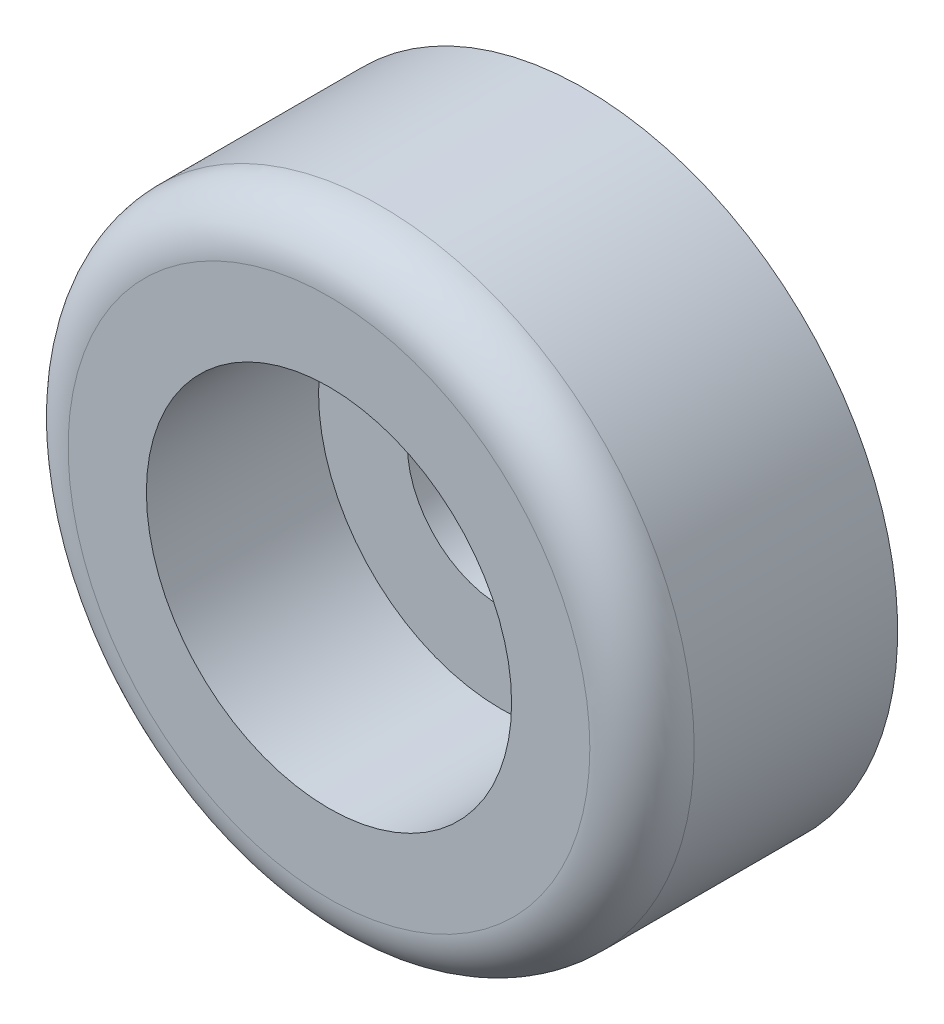
ISO-10303-21;
HEADER;
FILE_DESCRIPTION(('STEP AP214'),'2;1');
FILE_NAME('part.step','',(''),(''),'','','');
FILE_SCHEMA(('AUTOMOTIVE_DESIGN { 1 0 10303 214 1 1 1 1 }'));
ENDSEC;
DATA;
#1=APPLICATION_CONTEXT('core data for automotive mechanical design processes');
#2=APPLICATION_PROTOCOL_DEFINITION('international standard','automotive_design',2000,#1);
#3=PRODUCT_CONTEXT('',#1,'mechanical');
#4=PRODUCT('Part','Part','',(#3));
#5=PRODUCT_RELATED_PRODUCT_CATEGORY('part','',(#4));
#6=PRODUCT_DEFINITION_FORMATION('','',#4);
#7=PRODUCT_DEFINITION_CONTEXT('part definition',#1,'design');
#8=PRODUCT_DEFINITION('design','',#6,#7);
#9=PRODUCT_DEFINITION_SHAPE('','',#8);
#10=(LENGTH_UNIT() NAMED_UNIT(*) SI_UNIT(.MILLI.,.METRE.));
#11=(NAMED_UNIT(*) PLANE_ANGLE_UNIT() SI_UNIT($,.RADIAN.));
#12=(NAMED_UNIT(*) SI_UNIT($,.STERADIAN.) SOLID_ANGLE_UNIT());
#13=UNCERTAINTY_MEASURE_WITH_UNIT(LENGTH_MEASURE(1.E-05),#10,'distance_accuracy_value','');
#14=(GEOMETRIC_REPRESENTATION_CONTEXT(3) GLOBAL_UNCERTAINTY_ASSIGNED_CONTEXT((#13)) GLOBAL_UNIT_ASSIGNED_CONTEXT((#10,
#11,#12)) REPRESENTATION_CONTEXT('',''));
#15=CARTESIAN_POINT('',(0.,0.,0.));
#16=DIRECTION('',(0.,0.,1.));
#17=DIRECTION('',(1.,0.,0.));
#18=AXIS2_PLACEMENT_3D('',#15,#16,#17);
#19=CARTESIAN_POINT('',(0.,0.,0.));
#20=DIRECTION('',(0.,0.,-1.));
#21=DIRECTION('',(-1.,0.,0.));
#22=AXIS2_PLACEMENT_3D('',#19,#20,#21);
#23=CYLINDRICAL_SURFACE('',#22,1.8);
#24=CARTESIAN_POINT('',(0.,0.,0.));
#25=DIRECTION('',(0.,0.,-1.));
#26=DIRECTION('',(-1.,0.,0.));
#27=AXIS2_PLACEMENT_3D('',#24,#25,#26);
#28=CIRCLE('',#27,1.8);
#29=CARTESIAN_POINT('',(-1.8,0.,0.));
#30=VERTEX_POINT('',#29);
#31=EDGE_CURVE('E62',#30,#30,#28,.T.);
#32=ORIENTED_EDGE('',*,*,#31,.T.);
#33=EDGE_LOOP('',(#32));
#34=FACE_BOUND('',#33,.T.);
#35=CARTESIAN_POINT('',(0.,0.,1.6));
#36=DIRECTION('',(0.,0.,-1.));
#37=DIRECTION('',(-1.,0.,0.));
#38=AXIS2_PLACEMENT_3D('',#35,#36,#37);
#39=CIRCLE('',#38,1.8);
#40=CARTESIAN_POINT('',(-1.8,0.,1.6));
#41=VERTEX_POINT('',#40);
#42=EDGE_CURVE('E77',#41,#41,#39,.T.);
#43=ORIENTED_EDGE('',*,*,#42,.F.);
#44=EDGE_LOOP('',(#43));
#45=FACE_BOUND('',#44,.T.);
#46=ADVANCED_FACE('F51',(#34,#45),#23,.F.);
#47=CARTESIAN_POINT('',(0.,1.8,0.));
#48=DIRECTION('',(0.,0.,-1.));
#49=DIRECTION('',(-1.,0.,0.));
#50=AXIS2_PLACEMENT_3D('',#47,#48,#49);
#51=PLANE('',#50);
#52=CARTESIAN_POINT('',(0.,0.,0.));
#53=DIRECTION('',(0.,0.,-1.));
#54=DIRECTION('',(-1.,0.,0.));
#55=AXIS2_PLACEMENT_3D('',#52,#53,#54);
#56=CIRCLE('',#55,6.);
#57=CARTESIAN_POINT('',(-6.,0.,0.));
#58=VERTEX_POINT('',#57);
#59=EDGE_CURVE('E66',#58,#58,#56,.T.);
#60=ORIENTED_EDGE('',*,*,#59,.T.);
#61=EDGE_LOOP('',(#60));
#62=FACE_BOUND('',#61,.T.);
#63=ORIENTED_EDGE('',*,*,#31,.F.);
#64=EDGE_LOOP('',(#63));
#65=FACE_BOUND('',#64,.T.);
#66=ADVANCED_FACE('F85',(#62,#65),#51,.T.);
#67=CARTESIAN_POINT('',(0.,0.,0.));
#68=DIRECTION('',(0.,0.,-1.));
#69=DIRECTION('',(-1.,0.,0.));
#70=AXIS2_PLACEMENT_3D('',#67,#68,#69);
#71=CYLINDRICAL_SURFACE('',#70,6.);
#72=CARTESIAN_POINT('',(0.,0.,3.9));
#73=DIRECTION('',(0.,0.,1.));
#74=DIRECTION('',(1.,0.,0.));
#75=AXIS2_PLACEMENT_3D('',#72,#73,#74);
#76=CIRCLE('',#75,6.);
#77=CARTESIAN_POINT('',(6.,0.,3.9));
#78=VERTEX_POINT('',#77);
#79=EDGE_CURVE('E58',#78,#78,#76,.F.);
#80=ORIENTED_EDGE('',*,*,#79,.T.);
#81=EDGE_LOOP('',(#80));
#82=FACE_BOUND('',#81,.T.);
#83=ORIENTED_EDGE('',*,*,#59,.F.);
#84=EDGE_LOOP('',(#83));
#85=FACE_BOUND('',#84,.T.);
#86=ADVANCED_FACE('F90',(#82,#85),#71,.T.);
#87=CARTESIAN_POINT('',(0.,6.,4.9));
#88=DIRECTION('',(0.,0.,1.));
#89=DIRECTION('',(1.,0.,0.));
#90=AXIS2_PLACEMENT_3D('',#87,#88,#89);
#91=PLANE('',#90);
#92=CARTESIAN_POINT('',(0.,0.,4.9));
#93=DIRECTION('',(0.,0.,1.));
#94=DIRECTION('',(1.,0.,0.));
#95=AXIS2_PLACEMENT_3D('',#92,#93,#94);
#96=CIRCLE('',#95,5.);
#97=CARTESIAN_POINT('',(5.,0.,4.9));
#98=VERTEX_POINT('',#97);
#99=EDGE_CURVE('E12',#98,#98,#96,.T.);
#100=ORIENTED_EDGE('',*,*,#99,.T.);
#101=EDGE_LOOP('',(#100));
#102=FACE_BOUND('',#101,.T.);
#103=CARTESIAN_POINT('',(0.,0.,4.9));
#104=DIRECTION('',(0.,0.,-1.));
#105=DIRECTION('',(-1.,0.,0.));
#106=AXIS2_PLACEMENT_3D('',#103,#104,#105);
#107=CIRCLE('',#106,3.5);
#108=CARTESIAN_POINT('',(-3.5,0.,4.9));
#109=VERTEX_POINT('',#108);
#110=EDGE_CURVE('E71',#109,#109,#107,.T.);
#111=ORIENTED_EDGE('',*,*,#110,.T.);
#112=EDGE_LOOP('',(#111));
#113=FACE_BOUND('',#112,.T.);
#114=ADVANCED_FACE('F96',(#102,#113),#91,.T.);
#115=CARTESIAN_POINT('',(0.,0.,0.));
#116=DIRECTION('',(0.,0.,-1.));
#117=DIRECTION('',(-1.,0.,0.));
#118=AXIS2_PLACEMENT_3D('',#115,#116,#117);
#119=CYLINDRICAL_SURFACE('',#118,3.5);
#120=CARTESIAN_POINT('',(0.,0.,1.6));
#121=DIRECTION('',(0.,0.,-1.));
#122=DIRECTION('',(-1.,0.,0.));
#123=AXIS2_PLACEMENT_3D('',#120,#121,#122);
#124=CIRCLE('',#123,3.5);
#125=CARTESIAN_POINT('',(-3.5,0.,1.6));
#126=VERTEX_POINT('',#125);
#127=EDGE_CURVE('E74',#126,#126,#124,.T.);
#128=ORIENTED_EDGE('',*,*,#127,.T.);
#129=EDGE_LOOP('',(#128));
#130=FACE_BOUND('',#129,.T.);
#131=ORIENTED_EDGE('',*,*,#110,.F.);
#132=EDGE_LOOP('',(#131));
#133=FACE_BOUND('',#132,.T.);
#134=ADVANCED_FACE('F99',(#130,#133),#119,.F.);
#135=CARTESIAN_POINT('',(0.,3.5,1.6));
#136=DIRECTION('',(0.,0.,1.));
#137=DIRECTION('',(1.,0.,0.));
#138=AXIS2_PLACEMENT_3D('',#135,#136,#137);
#139=PLANE('',#138);
#140=ORIENTED_EDGE('',*,*,#42,.T.);
#141=EDGE_LOOP('',(#140));
#142=FACE_BOUND('',#141,.T.);
#143=ORIENTED_EDGE('',*,*,#127,.F.);
#144=EDGE_LOOP('',(#143));
#145=FACE_BOUND('',#144,.T.);
#146=ADVANCED_FACE('F81',(#142,#145),#139,.T.);
#147=CARTESIAN_POINT('',(0.,0.,3.9));
#148=DIRECTION('',(0.,0.,1.));
#149=DIRECTION('',(1.,0.,0.));
#150=AXIS2_PLACEMENT_3D('',#147,#148,#149);
#151=TOROIDAL_SURFACE('',#150,5.,1.);
#152=ORIENTED_EDGE('',*,*,#99,.F.);
#153=EDGE_LOOP('',(#152));
#154=FACE_BOUND('',#153,.T.);
#155=ORIENTED_EDGE('',*,*,#79,.F.);
#156=EDGE_LOOP('',(#155));
#157=FACE_BOUND('',#156,.T.);
#158=ADVANCED_FACE('F53',(#154,#157),#151,.T.);
#159=CLOSED_SHELL('',(#46,#66,#86,#114,#134,#146,#158));
#160=MANIFOLD_SOLID_BREP('B2',#159);
#161=ADVANCED_BREP_SHAPE_REPRESENTATION('',(#18,#160),#14);
#162=SHAPE_DEFINITION_REPRESENTATION(#9,#161);
ENDSEC;
END-ISO-10303-21;
